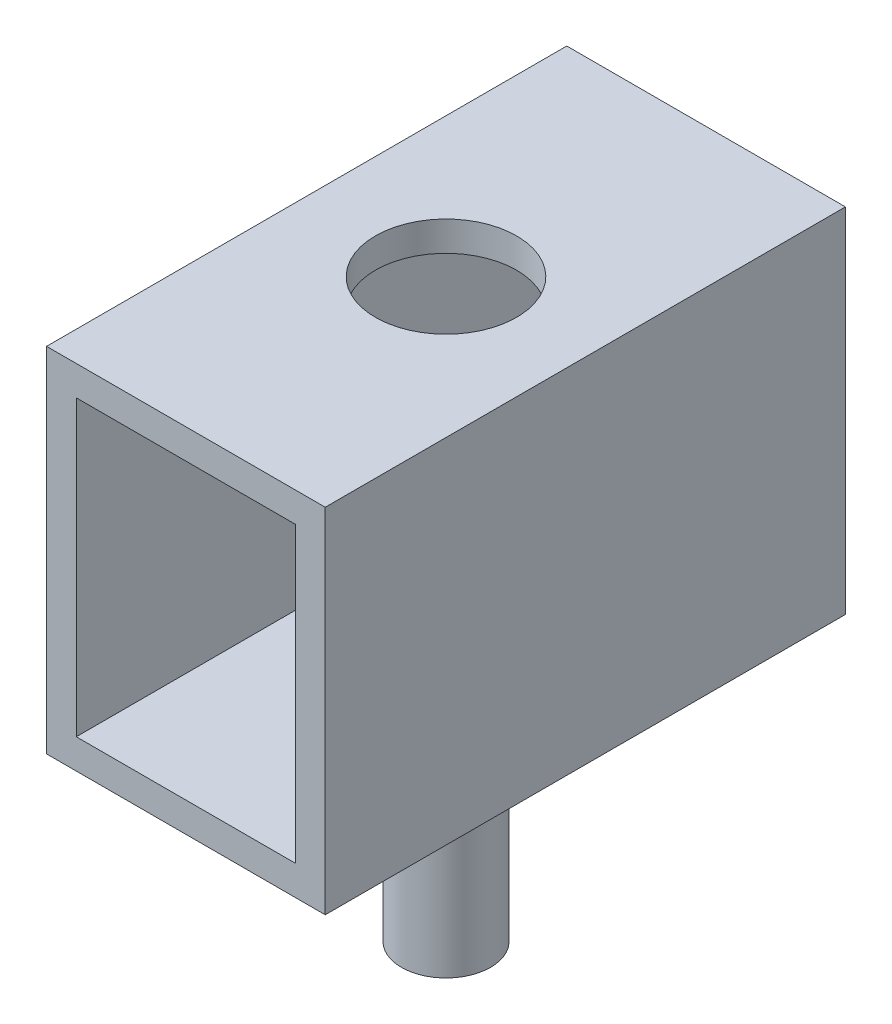
ISO-10303-21;
HEADER;
FILE_DESCRIPTION(('STEP AP214'),'2;1');
FILE_NAME('part.step','',(''),(''),'','','');
FILE_SCHEMA(('AUTOMOTIVE_DESIGN { 1 0 10303 214 1 1 1 1 }'));
ENDSEC;
DATA;
#1=APPLICATION_CONTEXT('core data for automotive mechanical design processes');
#2=APPLICATION_PROTOCOL_DEFINITION('international standard','automotive_design',2000,#1);
#3=PRODUCT_CONTEXT('',#1,'mechanical');
#4=PRODUCT('Part','Part','',(#3));
#5=PRODUCT_RELATED_PRODUCT_CATEGORY('part','',(#4));
#6=PRODUCT_DEFINITION_FORMATION('','',#4);
#7=PRODUCT_DEFINITION_CONTEXT('part definition',#1,'design');
#8=PRODUCT_DEFINITION('design','',#6,#7);
#9=PRODUCT_DEFINITION_SHAPE('','',#8);
#10=(LENGTH_UNIT() NAMED_UNIT(*) SI_UNIT(.MILLI.,.METRE.));
#11=(NAMED_UNIT(*) PLANE_ANGLE_UNIT() SI_UNIT($,.RADIAN.));
#12=(NAMED_UNIT(*) SI_UNIT($,.STERADIAN.) SOLID_ANGLE_UNIT());
#13=UNCERTAINTY_MEASURE_WITH_UNIT(LENGTH_MEASURE(1.E-05),#10,'distance_accuracy_value','');
#14=(GEOMETRIC_REPRESENTATION_CONTEXT(3) GLOBAL_UNCERTAINTY_ASSIGNED_CONTEXT((#13)) GLOBAL_UNIT_ASSIGNED_CONTEXT((#10,
#11,#12)) REPRESENTATION_CONTEXT('',''));
#15=CARTESIAN_POINT('',(0.,0.,0.));
#16=DIRECTION('',(0.,0.,1.));
#17=DIRECTION('',(1.,0.,0.));
#18=AXIS2_PLACEMENT_3D('',#15,#16,#17);
#19=CARTESIAN_POINT('',(0.,-4.875,3.5));
#20=DIRECTION('',(0.,1.,0.));
#21=DIRECTION('',(-1.,0.,0.));
#22=AXIS2_PLACEMENT_3D('',#19,#20,#21);
#23=CYLINDRICAL_SURFACE('',#22,0.6);
#24=CARTESIAN_POINT('',(0.,-4.875,3.5));
#25=DIRECTION('',(0.,-1.,0.));
#26=DIRECTION('',(1.,0.,0.));
#27=AXIS2_PLACEMENT_3D('',#24,#25,#26);
#28=CIRCLE('',#27,0.6);
#29=CARTESIAN_POINT('',(0.600000000000001,-4.875,3.5));
#30=VERTEX_POINT('',#29);
#31=EDGE_CURVE('E11',#30,#30,#28,.T.);
#32=ORIENTED_EDGE('',*,*,#31,.F.);
#33=EDGE_LOOP('',(#32));
#34=FACE_BOUND('',#33,.T.);
#35=CARTESIAN_POINT('',(0.,-1.875,3.5));
#36=DIRECTION('',(0.,-1.,0.));
#37=DIRECTION('',(1.,0.,0.));
#38=AXIS2_PLACEMENT_3D('',#35,#36,#37);
#39=CIRCLE('',#38,0.6);
#40=CARTESIAN_POINT('',(0.600000000000001,-1.875,3.5));
#41=VERTEX_POINT('',#40);
#42=EDGE_CURVE('E45',#41,#41,#39,.T.);
#43=ORIENTED_EDGE('',*,*,#42,.T.);
#44=EDGE_LOOP('',(#43));
#45=FACE_BOUND('',#44,.T.);
#46=ADVANCED_FACE('F42',(#34,#45),#23,.T.);
#47=CARTESIAN_POINT('',(0.,-4.875,3.5));
#48=DIRECTION('',(0.,-1.,0.));
#49=DIRECTION('',(1.,0.,0.));
#50=AXIS2_PLACEMENT_3D('',#47,#48,#49);
#51=PLANE('',#50);
#52=ORIENTED_EDGE('',*,*,#31,.T.);
#53=EDGE_LOOP('',(#52));
#54=FACE_BOUND('',#53,.T.);
#55=ADVANCED_FACE('F57',(#54),#51,.T.);
#56=CARTESIAN_POINT('',(0.,-1.875,3.5));
#57=DIRECTION('',(0.,-1.,0.));
#58=DIRECTION('',(1.,0.,0.));
#59=AXIS2_PLACEMENT_3D('',#56,#57,#58);
#60=PLANE('',#59);
#61=ORIENTED_EDGE('',*,*,#42,.F.);
#62=EDGE_LOOP('',(#61));
#63=FACE_BOUND('',#62,.T.);
#64=ADVANCED_FACE('F55',(#63),#60,.F.);
#65=CLOSED_SHELL('',(#46,#55,#64));
#66=MANIFOLD_SOLID_BREP('B2',#65);
#67=CARTESIAN_POINT('',(0.,0.,7.));
#68=DIRECTION('',(0.,0.,1.));
#69=DIRECTION('',(1.,0.,0.));
#70=AXIS2_PLACEMENT_3D('',#67,#68,#69);
#71=PLANE('',#70);
#72=DIRECTION('',(0.,-1.,0.));
#73=VECTOR('',#72,1.);
#74=CARTESIAN_POINT('',(-1.875,-1.875,7.));
#75=LINE('',#74,#73);
#76=CARTESIAN_POINT('',(-1.875,2.875,7.));
#77=VERTEX_POINT('',#76);
#78=CARTESIAN_POINT('',(-1.875,-1.875,7.));
#79=VERTEX_POINT('',#78);
#80=EDGE_CURVE('E185',#77,#79,#75,.T.);
#81=ORIENTED_EDGE('',*,*,#80,.T.);
#82=DIRECTION('',(1.,0.,0.));
#83=VECTOR('',#82,1.);
#84=CARTESIAN_POINT('',(1.875,-1.875,7.));
#85=LINE('',#84,#83);
#86=CARTESIAN_POINT('',(1.875,-1.875,7.));
#87=VERTEX_POINT('',#86);
#88=EDGE_CURVE('E188',#79,#87,#85,.T.);
#89=ORIENTED_EDGE('',*,*,#88,.T.);
#90=DIRECTION('',(0.,1.,0.));
#91=VECTOR('',#90,1.);
#92=CARTESIAN_POINT('',(1.875,-1.875,7.));
#93=LINE('',#92,#91);
#94=CARTESIAN_POINT('',(1.875,2.875,7.));
#95=VERTEX_POINT('',#94);
#96=EDGE_CURVE('E191',#87,#95,#93,.T.);
#97=ORIENTED_EDGE('',*,*,#96,.T.);
#98=DIRECTION('',(-1.,0.,0.));
#99=VECTOR('',#98,1.);
#100=CARTESIAN_POINT('',(1.875,2.875,7.));
#101=LINE('',#100,#99);
#102=EDGE_CURVE('E193',#95,#77,#101,.T.);
#103=ORIENTED_EDGE('',*,*,#102,.T.);
#104=EDGE_LOOP('',(#81,#89,#97,#103));
#105=FACE_BOUND('',#104,.T.);
#106=DIRECTION('',(0.,1.,0.));
#107=VECTOR('',#106,1.);
#108=CARTESIAN_POINT('',(1.475,-1.475,7.));
#109=LINE('',#108,#107);
#110=CARTESIAN_POINT('',(1.475,-1.475,7.));
#111=VERTEX_POINT('',#110);
#112=CARTESIAN_POINT('',(1.475,2.475,7.));
#113=VERTEX_POINT('',#112);
#114=EDGE_CURVE('E155',#111,#113,#109,.T.);
#115=ORIENTED_EDGE('',*,*,#114,.F.);
#116=DIRECTION('',(1.,0.,0.));
#117=VECTOR('',#116,1.);
#118=CARTESIAN_POINT('',(1.475,-1.475,7.));
#119=LINE('',#118,#117);
#120=CARTESIAN_POINT('',(-1.475,-1.475,7.));
#121=VERTEX_POINT('',#120);
#122=EDGE_CURVE('E147',#121,#111,#119,.T.);
#123=ORIENTED_EDGE('',*,*,#122,.F.);
#124=DIRECTION('',(0.,-1.,0.));
#125=VECTOR('',#124,1.);
#126=CARTESIAN_POINT('',(-1.475,-1.475,7.));
#127=LINE('',#126,#125);
#128=CARTESIAN_POINT('',(-1.475,2.475,7.));
#129=VERTEX_POINT('',#128);
#130=EDGE_CURVE('E169',#129,#121,#127,.T.);
#131=ORIENTED_EDGE('',*,*,#130,.F.);
#132=DIRECTION('',(-1.,0.,0.));
#133=VECTOR('',#132,1.);
#134=CARTESIAN_POINT('',(1.475,2.475,7.));
#135=LINE('',#134,#133);
#136=EDGE_CURVE('E167',#113,#129,#135,.T.);
#137=ORIENTED_EDGE('',*,*,#136,.F.);
#138=EDGE_LOOP('',(#115,#123,#131,#137));
#139=FACE_BOUND('',#138,.T.);
#140=ADVANCED_FACE('F82',(#105,#139),#71,.T.);
#141=CARTESIAN_POINT('',(0.,0.,0.));
#142=DIRECTION('',(0.,0.,1.));
#143=DIRECTION('',(1.,0.,0.));
#144=AXIS2_PLACEMENT_3D('',#141,#142,#143);
#145=PLANE('',#144);
#146=DIRECTION('',(0.,-1.,0.));
#147=VECTOR('',#146,1.);
#148=CARTESIAN_POINT('',(-1.875,-1.875,0.));
#149=LINE('',#148,#147);
#150=CARTESIAN_POINT('',(-1.875,2.875,0.));
#151=VERTEX_POINT('',#150);
#152=CARTESIAN_POINT('',(-1.875,-1.875,0.));
#153=VERTEX_POINT('',#152);
#154=EDGE_CURVE('E163',#151,#153,#149,.T.);
#155=ORIENTED_EDGE('',*,*,#154,.F.);
#156=DIRECTION('',(-1.,0.,0.));
#157=VECTOR('',#156,1.);
#158=CARTESIAN_POINT('',(1.875,2.875,0.));
#159=LINE('',#158,#157);
#160=CARTESIAN_POINT('',(1.875,2.875,0.));
#161=VERTEX_POINT('',#160);
#162=EDGE_CURVE('E189',#161,#151,#159,.T.);
#163=ORIENTED_EDGE('',*,*,#162,.F.);
#164=DIRECTION('',(0.,1.,0.));
#165=VECTOR('',#164,1.);
#166=CARTESIAN_POINT('',(1.875,-1.875,0.));
#167=LINE('',#166,#165);
#168=CARTESIAN_POINT('',(1.875,-1.875,0.));
#169=VERTEX_POINT('',#168);
#170=EDGE_CURVE('E200',#169,#161,#167,.T.);
#171=ORIENTED_EDGE('',*,*,#170,.F.);
#172=DIRECTION('',(1.,0.,0.));
#173=VECTOR('',#172,1.);
#174=CARTESIAN_POINT('',(1.875,-1.875,0.));
#175=LINE('',#174,#173);
#176=EDGE_CURVE('E198',#153,#169,#175,.T.);
#177=ORIENTED_EDGE('',*,*,#176,.F.);
#178=EDGE_LOOP('',(#155,#163,#171,#177));
#179=FACE_BOUND('',#178,.T.);
#180=DIRECTION('',(1.,0.,0.));
#181=VECTOR('',#180,1.);
#182=CARTESIAN_POINT('',(1.475,-1.475,0.));
#183=LINE('',#182,#181);
#184=CARTESIAN_POINT('',(-1.475,-1.475,0.));
#185=VERTEX_POINT('',#184);
#186=CARTESIAN_POINT('',(1.475,-1.475,0.));
#187=VERTEX_POINT('',#186);
#188=EDGE_CURVE('E105',#185,#187,#183,.T.);
#189=ORIENTED_EDGE('',*,*,#188,.T.);
#190=DIRECTION('',(0.,1.,0.));
#191=VECTOR('',#190,1.);
#192=CARTESIAN_POINT('',(1.475,-1.475,0.));
#193=LINE('',#192,#191);
#194=CARTESIAN_POINT('',(1.475,2.475,0.));
#195=VERTEX_POINT('',#194);
#196=EDGE_CURVE('E162',#187,#195,#193,.T.);
#197=ORIENTED_EDGE('',*,*,#196,.T.);
#198=DIRECTION('',(-1.,0.,0.));
#199=VECTOR('',#198,1.);
#200=CARTESIAN_POINT('',(1.475,2.475,0.));
#201=LINE('',#200,#199);
#202=CARTESIAN_POINT('',(-1.475,2.475,0.));
#203=VERTEX_POINT('',#202);
#204=EDGE_CURVE('E177',#195,#203,#201,.T.);
#205=ORIENTED_EDGE('',*,*,#204,.T.);
#206=DIRECTION('',(0.,-1.,0.));
#207=VECTOR('',#206,1.);
#208=CARTESIAN_POINT('',(-1.475,-1.475,0.));
#209=LINE('',#208,#207);
#210=EDGE_CURVE('E156',#203,#185,#209,.T.);
#211=ORIENTED_EDGE('',*,*,#210,.T.);
#212=EDGE_LOOP('',(#189,#197,#205,#211));
#213=FACE_BOUND('',#212,.T.);
#214=ADVANCED_FACE('F218',(#179,#213),#145,.F.);
#215=CARTESIAN_POINT('',(-1.875,-1.875,7.));
#216=DIRECTION('',(1.,0.,0.));
#217=DIRECTION('',(0.,0.,-1.));
#218=AXIS2_PLACEMENT_3D('',#215,#216,#217);
#219=PLANE('',#218);
#220=ORIENTED_EDGE('',*,*,#154,.T.);
#221=DIRECTION('',(0.,0.,-1.));
#222=VECTOR('',#221,1.);
#223=CARTESIAN_POINT('',(-1.875,-1.875,7.));
#224=LINE('',#223,#222);
#225=EDGE_CURVE('E40',#79,#153,#224,.T.);
#226=ORIENTED_EDGE('',*,*,#225,.F.);
#227=ORIENTED_EDGE('',*,*,#80,.F.);
#228=DIRECTION('',(0.,0.,-1.));
#229=VECTOR('',#228,1.);
#230=CARTESIAN_POINT('',(-1.875,2.875,7.));
#231=LINE('',#230,#229);
#232=EDGE_CURVE('E195',#77,#151,#231,.T.);
#233=ORIENTED_EDGE('',*,*,#232,.T.);
#234=EDGE_LOOP('',(#220,#226,#227,#233));
#235=FACE_BOUND('',#234,.T.);
#236=ADVANCED_FACE('F84',(#235),#219,.F.);
#237=CARTESIAN_POINT('',(1.875,-1.875,7.));
#238=DIRECTION('',(0.,1.,0.));
#239=DIRECTION('',(-1.,0.,0.));
#240=AXIS2_PLACEMENT_3D('',#237,#238,#239);
#241=PLANE('',#240);
#242=ORIENTED_EDGE('',*,*,#176,.T.);
#243=DIRECTION('',(0.,0.,-1.));
#244=VECTOR('',#243,1.);
#245=CARTESIAN_POINT('',(1.875,-1.875,7.));
#246=LINE('',#245,#244);
#247=EDGE_CURVE('E90',#87,#169,#246,.T.);
#248=ORIENTED_EDGE('',*,*,#247,.F.);
#249=ORIENTED_EDGE('',*,*,#88,.F.);
#250=ORIENTED_EDGE('',*,*,#225,.T.);
#251=EDGE_LOOP('',(#242,#248,#249,#250));
#252=FACE_BOUND('',#251,.T.);
#253=ADVANCED_FACE('F228',(#252),#241,.F.);
#254=CARTESIAN_POINT('',(1.875,-1.875,7.));
#255=DIRECTION('',(-1.,0.,0.));
#256=DIRECTION('',(0.,0.,1.));
#257=AXIS2_PLACEMENT_3D('',#254,#255,#256);
#258=PLANE('',#257);
#259=ORIENTED_EDGE('',*,*,#170,.T.);
#260=DIRECTION('',(0.,0.,-1.));
#261=VECTOR('',#260,1.);
#262=CARTESIAN_POINT('',(1.875,2.875,7.));
#263=LINE('',#262,#261);
#264=EDGE_CURVE('E205',#95,#161,#263,.T.);
#265=ORIENTED_EDGE('',*,*,#264,.F.);
#266=ORIENTED_EDGE('',*,*,#96,.F.);
#267=ORIENTED_EDGE('',*,*,#247,.T.);
#268=EDGE_LOOP('',(#259,#265,#266,#267));
#269=FACE_BOUND('',#268,.T.);
#270=ADVANCED_FACE('F212',(#269),#258,.F.);
#271=CARTESIAN_POINT('',(1.875,2.875,7.));
#272=DIRECTION('',(0.,-1.,0.));
#273=DIRECTION('',(1.,0.,0.));
#274=AXIS2_PLACEMENT_3D('',#271,#272,#273);
#275=PLANE('',#274);
#276=CARTESIAN_POINT('',(0.,2.875,3.5));
#277=DIRECTION('',(0.,1.,0.));
#278=DIRECTION('',(-1.,0.,0.));
#279=AXIS2_PLACEMENT_3D('',#276,#277,#278);
#280=CIRCLE('',#279,0.950000000000001);
#281=CARTESIAN_POINT('',(-0.950000000000001,2.875,3.5));
#282=VERTEX_POINT('',#281);
#283=EDGE_CURVE('E251',#282,#282,#280,.T.);
#284=ORIENTED_EDGE('',*,*,#283,.F.);
#285=EDGE_LOOP('',(#284));
#286=FACE_BOUND('',#285,.T.);
#287=ORIENTED_EDGE('',*,*,#162,.T.);
#288=ORIENTED_EDGE('',*,*,#232,.F.);
#289=ORIENTED_EDGE('',*,*,#102,.F.);
#290=ORIENTED_EDGE('',*,*,#264,.T.);
#291=EDGE_LOOP('',(#287,#288,#289,#290));
#292=FACE_BOUND('',#291,.T.);
#293=ADVANCED_FACE('F222',(#286,#292),#275,.F.);
#294=CARTESIAN_POINT('',(1.475,-1.475,7.));
#295=DIRECTION('',(0.,1.,0.));
#296=DIRECTION('',(-1.,0.,0.));
#297=AXIS2_PLACEMENT_3D('',#294,#295,#296);
#298=PLANE('',#297);
#299=ORIENTED_EDGE('',*,*,#188,.F.);
#300=DIRECTION('',(0.,0.,-1.));
#301=VECTOR('',#300,1.);
#302=CARTESIAN_POINT('',(-1.475,-1.475,7.));
#303=LINE('',#302,#301);
#304=EDGE_CURVE('E151',#121,#185,#303,.T.);
#305=ORIENTED_EDGE('',*,*,#304,.F.);
#306=ORIENTED_EDGE('',*,*,#122,.T.);
#307=DIRECTION('',(0.,0.,-1.));
#308=VECTOR('',#307,1.);
#309=CARTESIAN_POINT('',(1.475,-1.475,7.));
#310=LINE('',#309,#308);
#311=EDGE_CURVE('E150',#111,#187,#310,.T.);
#312=ORIENTED_EDGE('',*,*,#311,.T.);
#313=EDGE_LOOP('',(#299,#305,#306,#312));
#314=FACE_BOUND('',#313,.T.);
#315=ADVANCED_FACE('F149',(#314),#298,.T.);
#316=CARTESIAN_POINT('',(1.475,-1.475,7.));
#317=DIRECTION('',(-1.,0.,0.));
#318=DIRECTION('',(0.,0.,1.));
#319=AXIS2_PLACEMENT_3D('',#316,#317,#318);
#320=PLANE('',#319);
#321=ORIENTED_EDGE('',*,*,#196,.F.);
#322=ORIENTED_EDGE('',*,*,#311,.F.);
#323=ORIENTED_EDGE('',*,*,#114,.T.);
#324=DIRECTION('',(0.,0.,-1.));
#325=VECTOR('',#324,1.);
#326=CARTESIAN_POINT('',(1.475,2.475,7.));
#327=LINE('',#326,#325);
#328=EDGE_CURVE('E164',#113,#195,#327,.T.);
#329=ORIENTED_EDGE('',*,*,#328,.T.);
#330=EDGE_LOOP('',(#321,#322,#323,#329));
#331=FACE_BOUND('',#330,.T.);
#332=ADVANCED_FACE('F159',(#331),#320,.T.);
#333=CARTESIAN_POINT('',(1.475,2.475,7.));
#334=DIRECTION('',(0.,-1.,0.));
#335=DIRECTION('',(1.,0.,0.));
#336=AXIS2_PLACEMENT_3D('',#333,#334,#335);
#337=PLANE('',#336);
#338=CARTESIAN_POINT('',(0.,2.475,3.5));
#339=DIRECTION('',(0.,-1.,0.));
#340=DIRECTION('',(1.,0.,0.));
#341=AXIS2_PLACEMENT_3D('',#338,#339,#340);
#342=CIRCLE('',#341,0.950000000000001);
#343=CARTESIAN_POINT('',(0.950000000000001,2.475,3.5));
#344=VERTEX_POINT('',#343);
#345=EDGE_CURVE('E175',#344,#344,#342,.F.);
#346=ORIENTED_EDGE('',*,*,#345,.T.);
#347=EDGE_LOOP('',(#346));
#348=FACE_BOUND('',#347,.T.);
#349=ORIENTED_EDGE('',*,*,#204,.F.);
#350=ORIENTED_EDGE('',*,*,#328,.F.);
#351=ORIENTED_EDGE('',*,*,#136,.T.);
#352=DIRECTION('',(0.,0.,-1.));
#353=VECTOR('',#352,1.);
#354=CARTESIAN_POINT('',(-1.475,2.475,7.));
#355=LINE('',#354,#353);
#356=EDGE_CURVE('E97',#129,#203,#355,.T.);
#357=ORIENTED_EDGE('',*,*,#356,.T.);
#358=EDGE_LOOP('',(#349,#350,#351,#357));
#359=FACE_BOUND('',#358,.T.);
#360=ADVANCED_FACE('F257',(#348,#359),#337,.T.);
#361=CARTESIAN_POINT('',(-1.475,-1.475,7.));
#362=DIRECTION('',(1.,0.,0.));
#363=DIRECTION('',(0.,1.,0.));
#364=AXIS2_PLACEMENT_3D('',#361,#362,#363);
#365=PLANE('',#364);
#366=ORIENTED_EDGE('',*,*,#210,.F.);
#367=ORIENTED_EDGE('',*,*,#356,.F.);
#368=ORIENTED_EDGE('',*,*,#130,.T.);
#369=ORIENTED_EDGE('',*,*,#304,.T.);
#370=EDGE_LOOP('',(#366,#367,#368,#369));
#371=FACE_BOUND('',#370,.T.);
#372=ADVANCED_FACE('F262',(#371),#365,.T.);
#373=CARTESIAN_POINT('',(0.,-0.212005768508882,3.5));
#374=DIRECTION('',(0.,1.,0.));
#375=DIRECTION('',(-1.,0.,0.));
#376=AXIS2_PLACEMENT_3D('',#373,#374,#375);
#377=CYLINDRICAL_SURFACE('',#376,0.950000000000001);
#378=ORIENTED_EDGE('',*,*,#283,.T.);
#379=EDGE_LOOP('',(#378));
#380=FACE_BOUND('',#379,.T.);
#381=ORIENTED_EDGE('',*,*,#345,.F.);
#382=EDGE_LOOP('',(#381));
#383=FACE_BOUND('',#382,.T.);
#384=ADVANCED_FACE('F260',(#380,#383),#377,.F.);
#385=CLOSED_SHELL('',(#140,#214,#236,#253,#270,#293,#315,#332,#360,#372,#384));
#386=MANIFOLD_SOLID_BREP('B6',#385);
#387=ADVANCED_BREP_SHAPE_REPRESENTATION('',(#18,#66,#386),#14);
#388=SHAPE_DEFINITION_REPRESENTATION(#9,#387);
ENDSEC;
END-ISO-10303-21;
